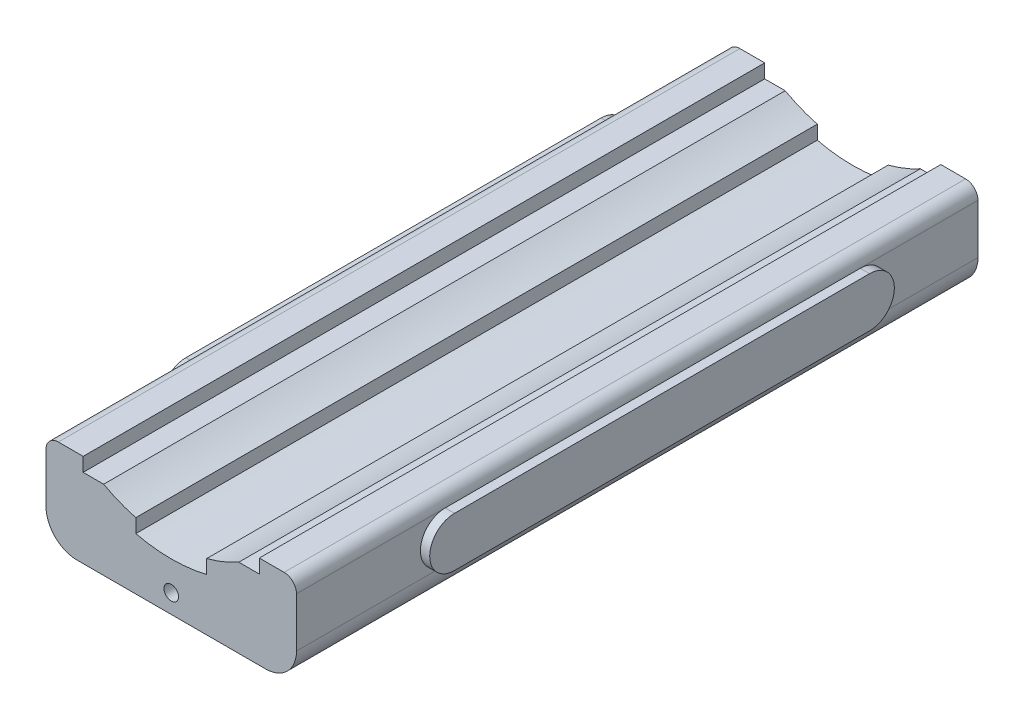
ISO-10303-21;
HEADER;
FILE_DESCRIPTION(('STEP AP214'),'2;1');
FILE_NAME('part.step','',(''),(''),'','','');
FILE_SCHEMA(('AUTOMOTIVE_DESIGN { 1 0 10303 214 1 1 1 1 }'));
ENDSEC;
DATA;
#1=APPLICATION_CONTEXT('core data for automotive mechanical design processes');
#2=APPLICATION_PROTOCOL_DEFINITION('international standard','automotive_design',2000,#1);
#3=PRODUCT_CONTEXT('',#1,'mechanical');
#4=PRODUCT('Part','Part','',(#3));
#5=PRODUCT_RELATED_PRODUCT_CATEGORY('part','',(#4));
#6=PRODUCT_DEFINITION_FORMATION('','',#4);
#7=PRODUCT_DEFINITION_CONTEXT('part definition',#1,'design');
#8=PRODUCT_DEFINITION('design','',#6,#7);
#9=PRODUCT_DEFINITION_SHAPE('','',#8);
#10=(LENGTH_UNIT() NAMED_UNIT(*) SI_UNIT(.MILLI.,.METRE.));
#11=(NAMED_UNIT(*) PLANE_ANGLE_UNIT() SI_UNIT($,.RADIAN.));
#12=(NAMED_UNIT(*) SI_UNIT($,.STERADIAN.) SOLID_ANGLE_UNIT());
#13=UNCERTAINTY_MEASURE_WITH_UNIT(LENGTH_MEASURE(1.E-05),#10,'distance_accuracy_value','');
#14=(GEOMETRIC_REPRESENTATION_CONTEXT(3) GLOBAL_UNCERTAINTY_ASSIGNED_CONTEXT((#13)) GLOBAL_UNIT_ASSIGNED_CONTEXT((#10,
#11,#12)) REPRESENTATION_CONTEXT('',''));
#15=CARTESIAN_POINT('',(0.,0.,0.));
#16=DIRECTION('',(0.,0.,1.));
#17=DIRECTION('',(1.,0.,0.));
#18=AXIS2_PLACEMENT_3D('',#15,#16,#17);
#19=CARTESIAN_POINT('',(367.19802957243,117.225625203814,-746.69724518585));
#20=DIRECTION('',(1.,0.,0.));
#21=DIRECTION('',(0.,0.,-1.));
#22=AXIS2_PLACEMENT_3D('',#19,#20,#21);
#23=PLANE('',#22);
#24=DIRECTION('',(0.,0.,-1.));
#25=VECTOR('',#24,1.);
#26=CARTESIAN_POINT('',(367.19802957243,-38.7743747961858,657.302754814149));
#27=LINE('',#26,#25);
#28=CARTESIAN_POINT('',(367.19802957243,-38.7743747961858,594.902754814149));
#29=VERTEX_POINT('',#28);
#30=CARTESIAN_POINT('',(367.19802957243,-38.7743747961858,-450.29724518585));
#31=VERTEX_POINT('',#30);
#32=EDGE_CURVE('E291',#29,#31,#27,.T.);
#33=ORIENTED_EDGE('',*,*,#32,.T.);
#34=CARTESIAN_POINT('',(367.19802957243,23.6256252038142,-450.29724518585));
#35=DIRECTION('',(1.,0.,0.));
#36=DIRECTION('',(0.,0.,-1.));
#37=AXIS2_PLACEMENT_3D('',#34,#35,#36);
#38=CIRCLE('',#37,62.4);
#39=CARTESIAN_POINT('',(367.19802957243,86.0256252038141,-450.29724518585));
#40=VERTEX_POINT('',#39);
#41=EDGE_CURVE('E273',#40,#31,#38,.F.);
#42=ORIENTED_EDGE('',*,*,#41,.F.);
#43=DIRECTION('',(0.,0.,1.));
#44=VECTOR('',#43,1.);
#45=CARTESIAN_POINT('',(367.19802957243,86.0256252038141,657.302754814149));
#46=LINE('',#45,#44);
#47=CARTESIAN_POINT('',(367.19802957243,86.0256252038141,594.902754814149));
#48=VERTEX_POINT('',#47);
#49=EDGE_CURVE('E297',#40,#48,#46,.T.);
#50=ORIENTED_EDGE('',*,*,#49,.T.);
#51=CARTESIAN_POINT('',(367.19802957243,23.6256252038142,594.902754814149));
#52=DIRECTION('',(1.,0.,0.));
#53=DIRECTION('',(0.,0.,-1.));
#54=AXIS2_PLACEMENT_3D('',#51,#52,#53);
#55=CIRCLE('',#54,62.4);
#56=EDGE_CURVE('E446',#48,#29,#55,.T.);
#57=ORIENTED_EDGE('',*,*,#56,.T.);
#58=EDGE_LOOP('',(#33,#42,#50,#57));
#59=FACE_BOUND('',#58,.T.);
#60=ADVANCED_FACE('F76',(#59),#23,.T.);
#61=CARTESIAN_POINT('',(367.19802957243,-38.7743747961858,657.302754814149));
#62=DIRECTION('',(0.,1.,0.));
#63=DIRECTION('',(0.,0.,1.));
#64=AXIS2_PLACEMENT_3D('',#61,#62,#63);
#65=PLANE('',#64);
#66=DIRECTION('',(1.,0.,0.));
#67=VECTOR('',#66,1.);
#68=CARTESIAN_POINT('',(343.79802957243,-38.7743747961858,-450.29724518585));
#69=LINE('',#68,#67);
#70=CARTESIAN_POINT('',(343.79802957243,-38.7743747961858,-450.29724518585));
#71=VERTEX_POINT('',#70);
#72=EDGE_CURVE('E276',#71,#31,#69,.T.);
#73=ORIENTED_EDGE('',*,*,#72,.T.);
#74=ORIENTED_EDGE('',*,*,#32,.F.);
#75=DIRECTION('',(1.,0.,0.));
#76=VECTOR('',#75,1.);
#77=CARTESIAN_POINT('',(343.79802957243,-38.7743747961858,594.902754814149));
#78=LINE('',#77,#76);
#79=CARTESIAN_POINT('',(343.79802957243,-38.7743747961858,594.902754814149));
#80=VERTEX_POINT('',#79);
#81=EDGE_CURVE('E287',#80,#29,#78,.T.);
#82=ORIENTED_EDGE('',*,*,#81,.F.);
#83=DIRECTION('',(0.,0.,-1.));
#84=VECTOR('',#83,1.);
#85=CARTESIAN_POINT('',(343.79802957243,-38.7743747961858,657.302754814149));
#86=LINE('',#85,#84);
#87=EDGE_CURVE('E256',#80,#71,#86,.T.);
#88=ORIENTED_EDGE('',*,*,#87,.T.);
#89=EDGE_LOOP('',(#73,#74,#82,#88));
#90=FACE_BOUND('',#89,.T.);
#91=ADVANCED_FACE('F285',(#90),#65,.F.);
#92=CARTESIAN_POINT('',(-310.334841033241,117.225625203814,-746.69724518585));
#93=DIRECTION('',(1.,0.,0.));
#94=DIRECTION('',(0.,1.,0.));
#95=AXIS2_PLACEMENT_3D('',#92,#93,#94);
#96=PLANE('',#95);
#97=CARTESIAN_POINT('',(-310.334841033241,23.6256252038142,593.531968518522));
#98=DIRECTION('',(-1.,0.,0.));
#99=DIRECTION('',(0.,-1.,0.));
#100=AXIS2_PLACEMENT_3D('',#97,#98,#99);
#101=CIRCLE('',#100,62.4);
#102=CARTESIAN_POINT('',(-310.334841033241,86.0256252038141,593.531968518521));
#103=VERTEX_POINT('',#102);
#104=CARTESIAN_POINT('',(-310.334841033241,-38.7743747961858,593.531968518522));
#105=VERTEX_POINT('',#104);
#106=EDGE_CURVE('E452',#103,#105,#101,.F.);
#107=ORIENTED_EDGE('',*,*,#106,.F.);
#108=DIRECTION('',(0.,0.,-1.));
#109=VECTOR('',#108,1.);
#110=CARTESIAN_POINT('',(-310.334841033241,86.0256252038141,655.931968518522));
#111=LINE('',#110,#109);
#112=CARTESIAN_POINT('',(-310.334841033241,86.0256252038141,-451.668031481478));
#113=VERTEX_POINT('',#112);
#114=EDGE_CURVE('E294',#103,#113,#111,.T.);
#115=ORIENTED_EDGE('',*,*,#114,.T.);
#116=CARTESIAN_POINT('',(-310.334841033241,23.6256252038142,-451.668031481478));
#117=DIRECTION('',(-1.,0.,0.));
#118=DIRECTION('',(0.,-1.,0.));
#119=AXIS2_PLACEMENT_3D('',#116,#117,#118);
#120=CIRCLE('',#119,62.4);
#121=CARTESIAN_POINT('',(-310.334841033241,-38.7743747961858,-451.668031481478));
#122=VERTEX_POINT('',#121);
#123=EDGE_CURVE('E466',#113,#122,#120,.T.);
#124=ORIENTED_EDGE('',*,*,#123,.T.);
#125=DIRECTION('',(0.,0.,1.));
#126=VECTOR('',#125,1.);
#127=CARTESIAN_POINT('',(-310.334841033241,-38.7743747961858,655.931968518522));
#128=LINE('',#127,#126);
#129=EDGE_CURVE('E289',#122,#105,#128,.T.);
#130=ORIENTED_EDGE('',*,*,#129,.T.);
#131=EDGE_LOOP('',(#107,#115,#124,#130));
#132=FACE_BOUND('',#131,.T.);
#133=ADVANCED_FACE('F516',(#132),#96,.F.);
#134=CARTESIAN_POINT('',(-310.334841033241,-38.7743747961858,655.931968518522));
#135=DIRECTION('',(0.,1.,0.));
#136=DIRECTION('',(-1.,0.,0.));
#137=AXIS2_PLACEMENT_3D('',#134,#135,#136);
#138=PLANE('',#137);
#139=DIRECTION('',(-1.,0.,0.));
#140=VECTOR('',#139,1.);
#141=CARTESIAN_POINT('',(-286.934841033241,-38.7743747961858,593.531968518522));
#142=LINE('',#141,#140);
#143=CARTESIAN_POINT('',(-286.934841033241,-38.7743747961858,593.531968518522));
#144=VERTEX_POINT('',#143);
#145=EDGE_CURVE('E459',#144,#105,#142,.T.);
#146=ORIENTED_EDGE('',*,*,#145,.T.);
#147=ORIENTED_EDGE('',*,*,#129,.F.);
#148=DIRECTION('',(-1.,0.,0.));
#149=VECTOR('',#148,1.);
#150=CARTESIAN_POINT('',(-286.934841033241,-38.7743747961858,-451.668031481478));
#151=LINE('',#150,#149);
#152=CARTESIAN_POINT('',(-286.934841033241,-38.7743747961858,-451.668031481478));
#153=VERTEX_POINT('',#152);
#154=EDGE_CURVE('E91',#153,#122,#151,.T.);
#155=ORIENTED_EDGE('',*,*,#154,.F.);
#156=DIRECTION('',(0.,0.,1.));
#157=VECTOR('',#156,1.);
#158=CARTESIAN_POINT('',(-286.934841033241,-38.7743747961858,655.931968518522));
#159=LINE('',#158,#157);
#160=EDGE_CURVE('E472',#153,#144,#159,.T.);
#161=ORIENTED_EDGE('',*,*,#160,.T.);
#162=EDGE_LOOP('',(#146,#147,#155,#161));
#163=FACE_BOUND('',#162,.T.);
#164=ADVANCED_FACE('F605',(#163),#138,.F.);
#165=CARTESIAN_POINT('',(-286.934841033241,117.225625203814,969.302754814149));
#166=DIRECTION('',(1.,0.,0.));
#167=DIRECTION('',(0.,1.,0.));
#168=AXIS2_PLACEMENT_3D('',#165,#166,#167);
#169=PLANE('',#168);
#170=DIRECTION('',(0.,0.,-1.));
#171=VECTOR('',#170,1.);
#172=CARTESIAN_POINT('',(-286.934841033241,86.0256252038141,969.302754814149));
#173=LINE('',#172,#171);
#174=CARTESIAN_POINT('',(-286.934841033241,86.0256252038141,969.302754814149));
#175=VERTEX_POINT('',#174);
#176=CARTESIAN_POINT('',(-286.934841033241,86.0256252038141,593.531968518521));
#177=VERTEX_POINT('',#176);
#178=EDGE_CURVE('E398',#175,#177,#173,.T.);
#179=ORIENTED_EDGE('',*,*,#178,.T.);
#180=CARTESIAN_POINT('',(-286.934841033241,23.6256252038142,593.531968518522));
#181=DIRECTION('',(-1.,0.,0.));
#182=DIRECTION('',(0.,-1.,0.));
#183=AXIS2_PLACEMENT_3D('',#180,#181,#182);
#184=CIRCLE('',#183,62.4);
#185=EDGE_CURVE('E457',#177,#144,#184,.F.);
#186=ORIENTED_EDGE('',*,*,#185,.T.);
#187=DIRECTION('',(0.,0.,-1.));
#188=VECTOR('',#187,1.);
#189=CARTESIAN_POINT('',(-286.934841033241,-38.7743747961858,969.302754814149));
#190=LINE('',#189,#188);
#191=CARTESIAN_POINT('',(-286.934841033241,-38.7743747961858,969.302754814149));
#192=VERTEX_POINT('',#191);
#193=EDGE_CURVE('E84',#144,#192,#190,.F.);
#194=ORIENTED_EDGE('',*,*,#193,.T.);
#195=DIRECTION('',(0.,-1.,0.));
#196=VECTOR('',#195,1.);
#197=CARTESIAN_POINT('',(-286.934841033241,117.225625203814,969.302754814149));
#198=LINE('',#197,#196);
#199=EDGE_CURVE('E322',#175,#192,#198,.T.);
#200=ORIENTED_EDGE('',*,*,#199,.F.);
#201=EDGE_LOOP('',(#179,#186,#194,#200));
#202=FACE_BOUND('',#201,.T.);
#203=ADVANCED_FACE('F594',(#202),#169,.F.);
#204=CARTESIAN_POINT('',(-286.934841033241,23.6256252038142,-451.668031481478));
#205=DIRECTION('',(-1.,0.,0.));
#206=DIRECTION('',(0.,-1.,0.));
#207=AXIS2_PLACEMENT_3D('',#204,#205,#206);
#208=CIRCLE('',#207,62.4);
#209=CARTESIAN_POINT('',(-286.934841033241,86.0256252038141,-451.668031481478));
#210=VERTEX_POINT('',#209);
#211=EDGE_CURVE('E467',#210,#153,#208,.T.);
#212=ORIENTED_EDGE('',*,*,#211,.F.);
#213=CARTESIAN_POINT('',(-286.934841033241,86.0256252038141,-746.69724518585));
#214=VERTEX_POINT('',#213);
#215=EDGE_CURVE('E397',#210,#214,#173,.T.);
#216=ORIENTED_EDGE('',*,*,#215,.T.);
#217=DIRECTION('',(0.,-1.,0.));
#218=VECTOR('',#217,1.);
#219=CARTESIAN_POINT('',(-286.934841033241,117.225625203814,-746.69724518585));
#220=LINE('',#219,#218);
#221=CARTESIAN_POINT('',(-286.934841033241,-38.7743747961858,-746.69724518585));
#222=VERTEX_POINT('',#221);
#223=EDGE_CURVE('E360',#214,#222,#220,.T.);
#224=ORIENTED_EDGE('',*,*,#223,.T.);
#225=EDGE_CURVE('E12',#222,#153,#190,.F.);
#226=ORIENTED_EDGE('',*,*,#225,.T.);
#227=EDGE_LOOP('',(#212,#216,#224,#226));
#228=FACE_BOUND('',#227,.T.);
#229=ADVANCED_FACE('F607',(#228),#169,.F.);
#230=CARTESIAN_POINT('',(343.79802957243,117.225625203814,969.302754814149));
#231=DIRECTION('',(1.,0.,0.));
#232=DIRECTION('',(0.,0.,-1.));
#233=AXIS2_PLACEMENT_3D('',#230,#231,#232);
#234=PLANE('',#233);
#235=DIRECTION('',(0.,0.,-1.));
#236=VECTOR('',#235,1.);
#237=CARTESIAN_POINT('',(343.79802957243,-38.7743747961858,-746.69724518585));
#238=LINE('',#237,#236);
#239=CARTESIAN_POINT('',(343.79802957243,-38.7743747961858,969.302754814149));
#240=VERTEX_POINT('',#239);
#241=EDGE_CURVE('E262',#240,#80,#238,.T.);
#242=ORIENTED_EDGE('',*,*,#241,.T.);
#243=CARTESIAN_POINT('',(343.79802957243,23.6256252038142,594.902754814149));
#244=DIRECTION('',(1.,0.,0.));
#245=DIRECTION('',(0.,0.,-1.));
#246=AXIS2_PLACEMENT_3D('',#243,#244,#245);
#247=CIRCLE('',#246,62.4);
#248=CARTESIAN_POINT('',(343.79802957243,86.0256252038141,594.902754814149));
#249=VERTEX_POINT('',#248);
#250=EDGE_CURVE('E435',#249,#80,#247,.T.);
#251=ORIENTED_EDGE('',*,*,#250,.F.);
#252=DIRECTION('',(0.,0.,-1.));
#253=VECTOR('',#252,1.);
#254=CARTESIAN_POINT('',(343.79802957243,86.0256252038141,969.302754814149));
#255=LINE('',#254,#253);
#256=CARTESIAN_POINT('',(343.79802957243,86.0256252038141,969.302754814149));
#257=VERTEX_POINT('',#256);
#258=EDGE_CURVE('E413',#249,#257,#255,.F.);
#259=ORIENTED_EDGE('',*,*,#258,.T.);
#260=DIRECTION('',(0.,-1.,0.));
#261=VECTOR('',#260,1.);
#262=CARTESIAN_POINT('',(343.79802957243,117.225625203814,969.302754814149));
#263=LINE('',#262,#261);
#264=EDGE_CURVE('E327',#257,#240,#263,.T.);
#265=ORIENTED_EDGE('',*,*,#264,.T.);
#266=EDGE_LOOP('',(#242,#251,#259,#265));
#267=FACE_BOUND('',#266,.T.);
#268=ADVANCED_FACE('F431',(#267),#234,.T.);
#269=CARTESIAN_POINT('',(343.79802957243,86.0256252038141,-746.69724518585));
#270=VERTEX_POINT('',#269);
#271=CARTESIAN_POINT('',(343.79802957243,86.0256252038141,-450.29724518585));
#272=VERTEX_POINT('',#271);
#273=EDGE_CURVE('E263',#270,#272,#255,.F.);
#274=ORIENTED_EDGE('',*,*,#273,.T.);
#275=CARTESIAN_POINT('',(343.79802957243,23.6256252038142,-450.29724518585));
#276=DIRECTION('',(1.,0.,0.));
#277=DIRECTION('',(0.,0.,-1.));
#278=AXIS2_PLACEMENT_3D('',#275,#276,#277);
#279=CIRCLE('',#278,62.4);
#280=EDGE_CURVE('E266',#272,#71,#279,.F.);
#281=ORIENTED_EDGE('',*,*,#280,.T.);
#282=CARTESIAN_POINT('',(343.79802957243,-38.7743747961858,-746.69724518585));
#283=VERTEX_POINT('',#282);
#284=EDGE_CURVE('E250',#71,#283,#238,.T.);
#285=ORIENTED_EDGE('',*,*,#284,.T.);
#286=DIRECTION('',(0.,-1.,0.));
#287=VECTOR('',#286,1.);
#288=CARTESIAN_POINT('',(343.79802957243,117.225625203814,-746.69724518585));
#289=LINE('',#288,#287);
#290=EDGE_CURVE('E366',#270,#283,#289,.T.);
#291=ORIENTED_EDGE('',*,*,#290,.F.);
#292=EDGE_LOOP('',(#274,#281,#285,#291));
#293=FACE_BOUND('',#292,.T.);
#294=ADVANCED_FACE('F268',(#293),#234,.T.);
#295=CARTESIAN_POINT('',(28.4315942695943,389.292984828362,969.302754814149));
#296=DIRECTION('',(0.,0.,-1.));
#297=DIRECTION('',(-1.,0.,0.));
#298=AXIS2_PLACEMENT_3D('',#295,#296,#297);
#299=CYLINDRICAL_SURFACE('',#298,351.);
#300=CARTESIAN_POINT('',(28.4315942695943,389.292984828362,-746.69724518585));
#301=DIRECTION('',(0.,0.,1.));
#302=DIRECTION('',(1.,0.,0.));
#303=AXIS2_PLACEMENT_3D('',#300,#301,#302);
#304=CIRCLE('',#303,351.);
#305=CARTESIAN_POINT('',(117.707946393413,49.8364589646461,-746.69724518585));
#306=VERTEX_POINT('',#305);
#307=CARTESIAN_POINT('',(198.555103217828,82.2767121274838,-746.69724518585));
#308=VERTEX_POINT('',#307);
#309=EDGE_CURVE('E338',#306,#308,#304,.T.);
#310=ORIENTED_EDGE('',*,*,#309,.F.);
#311=DIRECTION('',(0.,0.,-1.));
#312=VECTOR('',#311,1.);
#313=CARTESIAN_POINT('',(117.707946393413,49.8364589646461,969.302754814149));
#314=LINE('',#313,#312);
#315=CARTESIAN_POINT('',(117.707946393413,49.8364589646461,969.302754814149));
#316=VERTEX_POINT('',#315);
#317=EDGE_CURVE('E395',#316,#306,#314,.T.);
#318=ORIENTED_EDGE('',*,*,#317,.F.);
#319=CARTESIAN_POINT('',(28.4315942695943,389.292984828362,969.302754814149));
#320=DIRECTION('',(0.,0.,1.));
#321=DIRECTION('',(1.,0.,0.));
#322=AXIS2_PLACEMENT_3D('',#319,#320,#321);
#323=CIRCLE('',#322,351.);
#324=CARTESIAN_POINT('',(198.555103217828,82.2767121274838,969.302754814149));
#325=VERTEX_POINT('',#324);
#326=EDGE_CURVE('E300',#316,#325,#323,.T.);
#327=ORIENTED_EDGE('',*,*,#326,.T.);
#328=DIRECTION('',(0.,0.,-1.));
#329=VECTOR('',#328,1.);
#330=CARTESIAN_POINT('',(198.555103217828,82.2767121274838,969.302754814149));
#331=LINE('',#330,#329);
#332=EDGE_CURVE('E337',#325,#308,#331,.T.);
#333=ORIENTED_EDGE('',*,*,#332,.T.);
#334=EDGE_LOOP('',(#310,#318,#327,#333));
#335=FACE_BOUND('',#334,.T.);
#336=ADVANCED_FACE('F557',(#335),#299,.F.);
#337=CARTESIAN_POINT('',(117.707946393413,117.225625203813,969.302754814149));
#338=DIRECTION('',(1.,0.,0.));
#339=DIRECTION('',(0.,1.,0.));
#340=AXIS2_PLACEMENT_3D('',#337,#338,#339);
#341=PLANE('',#340);
#342=DIRECTION('',(0.,-1.,0.));
#343=VECTOR('',#342,1.);
#344=CARTESIAN_POINT('',(117.707946393413,117.225625203813,-746.69724518585));
#345=LINE('',#344,#343);
#346=CARTESIAN_POINT('',(117.707946393412,14.8875458883158,-746.69724518585));
#347=VERTEX_POINT('',#346);
#348=EDGE_CURVE('E341',#306,#347,#345,.T.);
#349=ORIENTED_EDGE('',*,*,#348,.T.);
#350=DIRECTION('',(0.,0.,-1.));
#351=VECTOR('',#350,1.);
#352=CARTESIAN_POINT('',(117.707946393412,14.8875458883158,969.302754814149));
#353=LINE('',#352,#351);
#354=CARTESIAN_POINT('',(117.707946393412,14.8875458883158,969.302754814149));
#355=VERTEX_POINT('',#354);
#356=EDGE_CURVE('E393',#355,#347,#353,.T.);
#357=ORIENTED_EDGE('',*,*,#356,.F.);
#358=DIRECTION('',(0.,-1.,0.));
#359=VECTOR('',#358,1.);
#360=CARTESIAN_POINT('',(117.707946393413,117.225625203813,969.302754814149));
#361=LINE('',#360,#359);
#362=EDGE_CURVE('E303',#316,#355,#361,.T.);
#363=ORIENTED_EDGE('',*,*,#362,.F.);
#364=ORIENTED_EDGE('',*,*,#317,.T.);
#365=EDGE_LOOP('',(#349,#357,#363,#364));
#366=FACE_BOUND('',#365,.T.);
#367=ADVANCED_FACE('F560',(#366),#341,.F.);
#368=CARTESIAN_POINT('',(28.4315942695943,389.292984828362,969.302754814149));
#369=DIRECTION('',(0.,0.,-1.));
#370=DIRECTION('',(-1.,0.,0.));
#371=AXIS2_PLACEMENT_3D('',#368,#369,#370);
#372=CYLINDRICAL_SURFACE('',#371,384.90219505275);
#373=CARTESIAN_POINT('',(28.4315942695943,389.292984828362,-746.69724518585));
#374=DIRECTION('',(0.,0.,1.));
#375=DIRECTION('',(1.,0.,0.));
#376=AXIS2_PLACEMENT_3D('',#373,#374,#375);
#377=CIRCLE('',#376,384.90219505275);
#378=CARTESIAN_POINT('',(-60.8447578542241,14.8875458883158,-746.69724518585));
#379=VERTEX_POINT('',#378);
#380=EDGE_CURVE('E344',#379,#347,#377,.T.);
#381=ORIENTED_EDGE('',*,*,#380,.F.);
#382=DIRECTION('',(0.,0.,-1.));
#383=VECTOR('',#382,1.);
#384=CARTESIAN_POINT('',(-60.8447578542241,14.8875458883158,969.302754814149));
#385=LINE('',#384,#383);
#386=CARTESIAN_POINT('',(-60.8447578542241,14.8875458883158,969.302754814149));
#387=VERTEX_POINT('',#386);
#388=EDGE_CURVE('E391',#387,#379,#385,.T.);
#389=ORIENTED_EDGE('',*,*,#388,.F.);
#390=CARTESIAN_POINT('',(28.4315942695943,389.292984828362,969.302754814149));
#391=DIRECTION('',(0.,0.,1.));
#392=DIRECTION('',(1.,0.,0.));
#393=AXIS2_PLACEMENT_3D('',#390,#391,#392);
#394=CIRCLE('',#393,384.90219505275);
#395=EDGE_CURVE('E306',#387,#355,#394,.T.);
#396=ORIENTED_EDGE('',*,*,#395,.T.);
#397=ORIENTED_EDGE('',*,*,#356,.T.);
#398=EDGE_LOOP('',(#381,#389,#396,#397));
#399=FACE_BOUND('',#398,.T.);
#400=ADVANCED_FACE('F563',(#399),#372,.F.);
#401=CARTESIAN_POINT('',(-60.8447578542247,117.225625203815,969.302754814149));
#402=DIRECTION('',(1.,0.,0.));
#403=DIRECTION('',(0.,1.,0.));
#404=AXIS2_PLACEMENT_3D('',#401,#402,#403);
#405=PLANE('',#404);
#406=DIRECTION('',(0.,-1.,0.));
#407=VECTOR('',#406,1.);
#408=CARTESIAN_POINT('',(-60.8447578542247,117.225625203815,-746.69724518585));
#409=LINE('',#408,#407);
#410=CARTESIAN_POINT('',(-60.8447578542243,49.8364589646461,-746.69724518585));
#411=VERTEX_POINT('',#410);
#412=EDGE_CURVE('E347',#411,#379,#409,.T.);
#413=ORIENTED_EDGE('',*,*,#412,.F.);
#414=DIRECTION('',(0.,0.,-1.));
#415=VECTOR('',#414,1.);
#416=CARTESIAN_POINT('',(-60.8447578542243,49.8364589646461,969.302754814149));
#417=LINE('',#416,#415);
#418=CARTESIAN_POINT('',(-60.8447578542243,49.8364589646461,969.302754814149));
#419=VERTEX_POINT('',#418);
#420=EDGE_CURVE('E389',#419,#411,#417,.T.);
#421=ORIENTED_EDGE('',*,*,#420,.F.);
#422=DIRECTION('',(0.,-1.,0.));
#423=VECTOR('',#422,1.);
#424=CARTESIAN_POINT('',(-60.8447578542247,117.225625203815,969.302754814149));
#425=LINE('',#424,#423);
#426=EDGE_CURVE('E309',#419,#387,#425,.T.);
#427=ORIENTED_EDGE('',*,*,#426,.T.);
#428=ORIENTED_EDGE('',*,*,#388,.T.);
#429=EDGE_LOOP('',(#413,#421,#427,#428));
#430=FACE_BOUND('',#429,.T.);
#431=ADVANCED_FACE('F568',(#430),#405,.T.);
#432=CARTESIAN_POINT('',(28.4315942695943,389.292984828362,969.302754814149));
#433=DIRECTION('',(0.,0.,-1.));
#434=DIRECTION('',(-1.,0.,0.));
#435=AXIS2_PLACEMENT_3D('',#432,#433,#434);
#436=CYLINDRICAL_SURFACE('',#435,351.);
#437=CARTESIAN_POINT('',(28.4315942695943,389.292984828362,-746.69724518585));
#438=DIRECTION('',(0.,0.,1.));
#439=DIRECTION('',(1.,0.,0.));
#440=AXIS2_PLACEMENT_3D('',#437,#438,#439);
#441=CIRCLE('',#440,351.);
#442=CARTESIAN_POINT('',(-141.69191467864,82.2767121274839,-746.69724518585));
#443=VERTEX_POINT('',#442);
#444=EDGE_CURVE('E350',#443,#411,#441,.T.);
#445=ORIENTED_EDGE('',*,*,#444,.F.);
#446=DIRECTION('',(0.,0.,-1.));
#447=VECTOR('',#446,1.);
#448=CARTESIAN_POINT('',(-141.69191467864,82.2767121274839,969.302754814149));
#449=LINE('',#448,#447);
#450=CARTESIAN_POINT('',(-141.69191467864,82.2767121274839,969.302754814149));
#451=VERTEX_POINT('',#450);
#452=EDGE_CURVE('E387',#451,#443,#449,.T.);
#453=ORIENTED_EDGE('',*,*,#452,.F.);
#454=CARTESIAN_POINT('',(28.4315942695943,389.292984828362,969.302754814149));
#455=DIRECTION('',(0.,0.,1.));
#456=DIRECTION('',(1.,0.,0.));
#457=AXIS2_PLACEMENT_3D('',#454,#455,#456);
#458=CIRCLE('',#457,351.);
#459=EDGE_CURVE('E312',#451,#419,#458,.T.);
#460=ORIENTED_EDGE('',*,*,#459,.T.);
#461=ORIENTED_EDGE('',*,*,#420,.T.);
#462=EDGE_LOOP('',(#445,#453,#460,#461));
#463=FACE_BOUND('',#462,.T.);
#464=ADVANCED_FACE('F571',(#463),#436,.F.);
#465=CARTESIAN_POINT('',(-193.334841033241,82.2767121274839,969.302754814149));
#466=DIRECTION('',(0.,-1.,0.));
#467=DIRECTION('',(0.,0.,-1.));
#468=AXIS2_PLACEMENT_3D('',#465,#466,#467);
#469=PLANE('',#468);
#470=DIRECTION('',(-1.,0.,0.));
#471=VECTOR('',#470,1.);
#472=CARTESIAN_POINT('',(-193.334841033241,82.2767121274839,-746.69724518585));
#473=LINE('',#472,#471);
#474=CARTESIAN_POINT('',(-193.334841033241,82.2767121274839,-746.69724518585));
#475=VERTEX_POINT('',#474);
#476=EDGE_CURVE('E353',#443,#475,#473,.T.);
#477=ORIENTED_EDGE('',*,*,#476,.T.);
#478=DIRECTION('',(0.,0.,-1.));
#479=VECTOR('',#478,1.);
#480=CARTESIAN_POINT('',(-193.334841033241,82.2767121274839,969.302754814149));
#481=LINE('',#480,#479);
#482=CARTESIAN_POINT('',(-193.334841033241,82.2767121274839,969.302754814149));
#483=VERTEX_POINT('',#482);
#484=EDGE_CURVE('E384',#483,#475,#481,.T.);
#485=ORIENTED_EDGE('',*,*,#484,.F.);
#486=DIRECTION('',(-1.,0.,0.));
#487=VECTOR('',#486,1.);
#488=CARTESIAN_POINT('',(-193.334841033241,82.2767121274839,969.302754814149));
#489=LINE('',#488,#487);
#490=EDGE_CURVE('E315',#451,#483,#489,.T.);
#491=ORIENTED_EDGE('',*,*,#490,.F.);
#492=ORIENTED_EDGE('',*,*,#452,.T.);
#493=EDGE_LOOP('',(#477,#485,#491,#492));
#494=FACE_BOUND('',#493,.T.);
#495=ADVANCED_FACE('F577',(#494),#469,.F.);
#496=CARTESIAN_POINT('',(-193.334841033241,117.225625203814,969.302754814149));
#497=DIRECTION('',(-1.,0.,0.));
#498=DIRECTION('',(0.,0.,1.));
#499=AXIS2_PLACEMENT_3D('',#496,#497,#498);
#500=PLANE('',#499);
#501=DIRECTION('',(0.,1.,0.));
#502=VECTOR('',#501,1.);
#503=CARTESIAN_POINT('',(-193.334841033241,117.225625203814,-746.69724518585));
#504=LINE('',#503,#502);
#505=CARTESIAN_POINT('',(-193.334841033241,117.225625203814,-746.69724518585));
#506=VERTEX_POINT('',#505);
#507=EDGE_CURVE('E355',#475,#506,#504,.T.);
#508=ORIENTED_EDGE('',*,*,#507,.T.);
#509=DIRECTION('',(0.,0.,-1.));
#510=VECTOR('',#509,1.);
#511=CARTESIAN_POINT('',(-193.334841033241,117.225625203814,969.302754814149));
#512=LINE('',#511,#510);
#513=CARTESIAN_POINT('',(-193.334841033241,117.225625203814,969.302754814149));
#514=VERTEX_POINT('',#513);
#515=EDGE_CURVE('E381',#514,#506,#512,.T.);
#516=ORIENTED_EDGE('',*,*,#515,.F.);
#517=DIRECTION('',(0.,1.,0.));
#518=VECTOR('',#517,1.);
#519=CARTESIAN_POINT('',(-193.334841033241,117.225625203814,969.302754814149));
#520=LINE('',#519,#518);
#521=EDGE_CURVE('E317',#483,#514,#520,.T.);
#522=ORIENTED_EDGE('',*,*,#521,.F.);
#523=ORIENTED_EDGE('',*,*,#484,.T.);
#524=EDGE_LOOP('',(#508,#516,#522,#523));
#525=FACE_BOUND('',#524,.T.);
#526=ADVANCED_FACE('F581',(#525),#500,.F.);
#527=CARTESIAN_POINT('',(-193.334841033241,117.225625203814,969.302754814149));
#528=DIRECTION('',(0.,-1.,0.));
#529=DIRECTION('',(1.,0.,0.));
#530=AXIS2_PLACEMENT_3D('',#527,#528,#529);
#531=PLANE('',#530);
#532=DIRECTION('',(-1.,0.,0.));
#533=VECTOR('',#532,1.);
#534=CARTESIAN_POINT('',(-193.334841033241,117.225625203814,-746.69724518585));
#535=LINE('',#534,#533);
#536=CARTESIAN_POINT('',(-255.734841033241,117.225625203814,-746.69724518585));
#537=VERTEX_POINT('',#536);
#538=EDGE_CURVE('E357',#506,#537,#535,.T.);
#539=ORIENTED_EDGE('',*,*,#538,.T.);
#540=DIRECTION('',(0.,0.,-1.));
#541=VECTOR('',#540,1.);
#542=CARTESIAN_POINT('',(-255.734841033241,117.225625203814,969.302754814149));
#543=LINE('',#542,#541);
#544=CARTESIAN_POINT('',(-255.734841033241,117.225625203814,969.302754814149));
#545=VERTEX_POINT('',#544);
#546=EDGE_CURVE('E404',#537,#545,#543,.F.);
#547=ORIENTED_EDGE('',*,*,#546,.T.);
#548=DIRECTION('',(-1.,0.,0.));
#549=VECTOR('',#548,1.);
#550=CARTESIAN_POINT('',(-193.334841033241,117.225625203814,969.302754814149));
#551=LINE('',#550,#549);
#552=EDGE_CURVE('E319',#514,#545,#551,.T.);
#553=ORIENTED_EDGE('',*,*,#552,.F.);
#554=ORIENTED_EDGE('',*,*,#515,.T.);
#555=EDGE_LOOP('',(#539,#547,#553,#554));
#556=FACE_BOUND('',#555,.T.);
#557=ADVANCED_FACE('F585',(#556),#531,.F.);
#558=CARTESIAN_POINT('',(-193.334841033241,-116.774374796186,969.302754814149));
#559=DIRECTION('',(0.,1.,0.));
#560=DIRECTION('',(0.,0.,1.));
#561=AXIS2_PLACEMENT_3D('',#558,#559,#560);
#562=PLANE('',#561);
#563=DIRECTION('',(1.,0.,0.));
#564=VECTOR('',#563,1.);
#565=CARTESIAN_POINT('',(-193.334841033241,-116.774374796186,-746.69724518585));
#566=LINE('',#565,#564);
#567=CARTESIAN_POINT('',(-208.934841033241,-116.774374796186,-746.69724518585));
#568=VERTEX_POINT('',#567);
#569=CARTESIAN_POINT('',(265.79802957243,-116.774374796186,-746.69724518585));
#570=VERTEX_POINT('',#569);
#571=EDGE_CURVE('E363',#568,#570,#566,.T.);
#572=ORIENTED_EDGE('',*,*,#571,.T.);
#573=DIRECTION('',(0.,0.,-1.));
#574=VECTOR('',#573,1.);
#575=CARTESIAN_POINT('',(265.79802957243,-116.774374796186,969.302754814149));
#576=LINE('',#575,#574);
#577=CARTESIAN_POINT('',(265.79802957243,-116.774374796186,969.302754814149));
#578=VERTEX_POINT('',#577);
#579=EDGE_CURVE('E421',#570,#578,#576,.F.);
#580=ORIENTED_EDGE('',*,*,#579,.T.);
#581=DIRECTION('',(1.,0.,0.));
#582=VECTOR('',#581,1.);
#583=CARTESIAN_POINT('',(-193.334841033241,-116.774374796186,969.302754814149));
#584=LINE('',#583,#582);
#585=CARTESIAN_POINT('',(-208.934841033241,-116.774374796186,969.302754814149));
#586=VERTEX_POINT('',#585);
#587=EDGE_CURVE('E324',#586,#578,#584,.T.);
#588=ORIENTED_EDGE('',*,*,#587,.F.);
#589=DIRECTION('',(0.,0.,-1.));
#590=VECTOR('',#589,1.);
#591=CARTESIAN_POINT('',(-208.934841033241,-116.774374796186,969.302754814149));
#592=LINE('',#591,#590);
#593=EDGE_CURVE('E418',#586,#568,#592,.T.);
#594=ORIENTED_EDGE('',*,*,#593,.T.);
#595=EDGE_LOOP('',(#572,#580,#588,#594));
#596=FACE_BOUND('',#595,.T.);
#597=ADVANCED_FACE('F537',(#596),#562,.F.);
#598=CARTESIAN_POINT('',(-193.334841033241,117.225625203814,969.302754814149));
#599=DIRECTION('',(0.,1.,0.));
#600=DIRECTION('',(0.,0.,1.));
#601=AXIS2_PLACEMENT_3D('',#598,#599,#600);
#602=PLANE('',#601);
#603=DIRECTION('',(1.,0.,0.));
#604=VECTOR('',#603,1.);
#605=CARTESIAN_POINT('',(-193.334841033241,117.225625203814,969.302754814149));
#606=LINE('',#605,#604);
#607=CARTESIAN_POINT('',(250.19802957243,117.225625203814,969.302754814149));
#608=VERTEX_POINT('',#607);
#609=CARTESIAN_POINT('',(312.59802957243,117.225625203814,969.302754814149));
#610=VERTEX_POINT('',#609);
#611=EDGE_CURVE('E330',#608,#610,#606,.T.);
#612=ORIENTED_EDGE('',*,*,#611,.T.);
#613=DIRECTION('',(0.,0.,-1.));
#614=VECTOR('',#613,1.);
#615=CARTESIAN_POINT('',(312.59802957243,117.225625203814,969.302754814149));
#616=LINE('',#615,#614);
#617=CARTESIAN_POINT('',(312.59802957243,117.225625203814,-746.69724518585));
#618=VERTEX_POINT('',#617);
#619=EDGE_CURVE('E410',#610,#618,#616,.T.);
#620=ORIENTED_EDGE('',*,*,#619,.T.);
#621=DIRECTION('',(1.,0.,0.));
#622=VECTOR('',#621,1.);
#623=CARTESIAN_POINT('',(-193.334841033241,117.225625203814,-746.69724518585));
#624=LINE('',#623,#622);
#625=CARTESIAN_POINT('',(250.19802957243,117.225625203814,-746.69724518585));
#626=VERTEX_POINT('',#625);
#627=EDGE_CURVE('E368',#626,#618,#624,.T.);
#628=ORIENTED_EDGE('',*,*,#627,.F.);
#629=DIRECTION('',(0.,0.,-1.));
#630=VECTOR('',#629,1.);
#631=CARTESIAN_POINT('',(250.19802957243,117.225625203814,969.302754814149));
#632=LINE('',#631,#630);
#633=EDGE_CURVE('E379',#608,#626,#632,.T.);
#634=ORIENTED_EDGE('',*,*,#633,.F.);
#635=EDGE_LOOP('',(#612,#620,#628,#634));
#636=FACE_BOUND('',#635,.T.);
#637=ADVANCED_FACE('F542',(#636),#602,.T.);
#638=CARTESIAN_POINT('',(250.19802957243,117.225625203814,969.302754814149));
#639=DIRECTION('',(1.,0.,0.));
#640=DIRECTION('',(0.,0.,-1.));
#641=AXIS2_PLACEMENT_3D('',#638,#639,#640);
#642=PLANE('',#641);
#643=DIRECTION('',(0.,-1.,0.));
#644=VECTOR('',#643,1.);
#645=CARTESIAN_POINT('',(250.19802957243,117.225625203814,-746.69724518585));
#646=LINE('',#645,#644);
#647=CARTESIAN_POINT('',(250.19802957243,82.276712127484,-746.69724518585));
#648=VERTEX_POINT('',#647);
#649=EDGE_CURVE('E371',#626,#648,#646,.T.);
#650=ORIENTED_EDGE('',*,*,#649,.T.);
#651=DIRECTION('',(0.,0.,-1.));
#652=VECTOR('',#651,1.);
#653=CARTESIAN_POINT('',(250.19802957243,82.276712127484,969.302754814149));
#654=LINE('',#653,#652);
#655=CARTESIAN_POINT('',(250.19802957243,82.276712127484,969.302754814149));
#656=VERTEX_POINT('',#655);
#657=EDGE_CURVE('E376',#656,#648,#654,.T.);
#658=ORIENTED_EDGE('',*,*,#657,.F.);
#659=DIRECTION('',(0.,-1.,0.));
#660=VECTOR('',#659,1.);
#661=CARTESIAN_POINT('',(250.19802957243,117.225625203814,969.302754814149));
#662=LINE('',#661,#660);
#663=EDGE_CURVE('E333',#608,#656,#662,.T.);
#664=ORIENTED_EDGE('',*,*,#663,.F.);
#665=ORIENTED_EDGE('',*,*,#633,.T.);
#666=EDGE_LOOP('',(#650,#658,#664,#665));
#667=FACE_BOUND('',#666,.T.);
#668=ADVANCED_FACE('F507',(#667),#642,.F.);
#669=CARTESIAN_POINT('',(-193.334841033241,82.276712127483,969.302754814149));
#670=DIRECTION('',(0.,-1.,0.));
#671=DIRECTION('',(1.,0.,0.));
#672=AXIS2_PLACEMENT_3D('',#669,#670,#671);
#673=PLANE('',#672);
#674=DIRECTION('',(-1.,0.,0.));
#675=VECTOR('',#674,1.);
#676=CARTESIAN_POINT('',(-193.334841033241,82.276712127483,-746.69724518585));
#677=LINE('',#676,#675);
#678=EDGE_CURVE('E304',#648,#308,#677,.T.);
#679=ORIENTED_EDGE('',*,*,#678,.T.);
#680=ORIENTED_EDGE('',*,*,#332,.F.);
#681=DIRECTION('',(-1.,0.,0.));
#682=VECTOR('',#681,1.);
#683=CARTESIAN_POINT('',(-193.334841033241,82.276712127483,969.302754814149));
#684=LINE('',#683,#682);
#685=EDGE_CURVE('E335',#656,#325,#684,.T.);
#686=ORIENTED_EDGE('',*,*,#685,.F.);
#687=ORIENTED_EDGE('',*,*,#657,.T.);
#688=EDGE_LOOP('',(#679,#680,#686,#687));
#689=FACE_BOUND('',#688,.T.);
#690=ADVANCED_FACE('F498',(#689),#673,.F.);
#691=CARTESIAN_POINT('',(-193.334841033241,117.225625203814,969.302754814149));
#692=DIRECTION('',(0.,0.,1.));
#693=DIRECTION('',(1.,0.,0.));
#694=AXIS2_PLACEMENT_3D('',#691,#692,#693);
#695=PLANE('',#694);
#696=CARTESIAN_POINT('',(28.4315942695942,-69.149265326827,969.302754814149));
#697=DIRECTION('',(0.,0.,1.));
#698=DIRECTION('',(1.,0.,0.));
#699=AXIS2_PLACEMENT_3D('',#696,#697,#698);
#700=CIRCLE('',#699,18.2669421317132);
#701=CARTESIAN_POINT('',(46.6985364013074,-69.149265326827,969.302754814149));
#702=VERTEX_POINT('',#701);
#703=EDGE_CURVE('E482',#702,#702,#700,.T.);
#704=ORIENTED_EDGE('',*,*,#703,.F.);
#705=EDGE_LOOP('',(#704));
#706=FACE_BOUND('',#705,.T.);
#707=ORIENTED_EDGE('',*,*,#587,.T.);
#708=CARTESIAN_POINT('',(265.79802957243,-38.7743747961858,969.302754814149));
#709=DIRECTION('',(0.,0.,1.));
#710=DIRECTION('',(1.,0.,0.));
#711=AXIS2_PLACEMENT_3D('',#708,#709,#710);
#712=CIRCLE('',#711,78.);
#713=EDGE_CURVE('E424',#578,#240,#712,.T.);
#714=ORIENTED_EDGE('',*,*,#713,.T.);
#715=ORIENTED_EDGE('',*,*,#264,.F.);
#716=CARTESIAN_POINT('',(312.59802957243,86.0256252038141,969.302754814149));
#717=DIRECTION('',(0.,0.,1.));
#718=DIRECTION('',(1.,0.,0.));
#719=AXIS2_PLACEMENT_3D('',#716,#717,#718);
#720=CIRCLE('',#719,31.2);
#721=EDGE_CURVE('E406',#257,#610,#720,.T.);
#722=ORIENTED_EDGE('',*,*,#721,.T.);
#723=ORIENTED_EDGE('',*,*,#611,.F.);
#724=ORIENTED_EDGE('',*,*,#663,.T.);
#725=ORIENTED_EDGE('',*,*,#685,.T.);
#726=ORIENTED_EDGE('',*,*,#326,.F.);
#727=ORIENTED_EDGE('',*,*,#362,.T.);
#728=ORIENTED_EDGE('',*,*,#395,.F.);
#729=ORIENTED_EDGE('',*,*,#426,.F.);
#730=ORIENTED_EDGE('',*,*,#459,.F.);
#731=ORIENTED_EDGE('',*,*,#490,.T.);
#732=ORIENTED_EDGE('',*,*,#521,.T.);
#733=ORIENTED_EDGE('',*,*,#552,.T.);
#734=CARTESIAN_POINT('',(-255.734841033241,86.0256252038141,969.302754814149));
#735=DIRECTION('',(0.,0.,1.));
#736=DIRECTION('',(1.,0.,0.));
#737=AXIS2_PLACEMENT_3D('',#734,#735,#736);
#738=CIRCLE('',#737,31.2);
#739=EDGE_CURVE('E408',#545,#175,#738,.T.);
#740=ORIENTED_EDGE('',*,*,#739,.T.);
#741=ORIENTED_EDGE('',*,*,#199,.T.);
#742=CARTESIAN_POINT('',(-208.934841033241,-38.7743747961858,969.302754814149));
#743=DIRECTION('',(0.,0.,1.));
#744=DIRECTION('',(1.,0.,0.));
#745=AXIS2_PLACEMENT_3D('',#742,#743,#744);
#746=CIRCLE('',#745,78.);
#747=EDGE_CURVE('E423',#192,#586,#746,.T.);
#748=ORIENTED_EDGE('',*,*,#747,.T.);
#749=EDGE_LOOP('',(#707,#714,#715,#722,#723,#724,#725,#726,#727,#728,#729,#730,#731,#732,#733,
#740,#741,#748));
#750=FACE_BOUND('',#749,.T.);
#751=ADVANCED_FACE('F427',(#706,#750),#695,.T.);
#752=CARTESIAN_POINT('',(-193.334841033241,117.225625203814,-746.69724518585));
#753=DIRECTION('',(0.,0.,1.));
#754=DIRECTION('',(1.,0.,0.));
#755=AXIS2_PLACEMENT_3D('',#752,#753,#754);
#756=PLANE('',#755);
#757=ORIENTED_EDGE('',*,*,#290,.T.);
#758=CARTESIAN_POINT('',(265.79802957243,-38.7743747961858,-746.69724518585));
#759=DIRECTION('',(0.,0.,1.));
#760=DIRECTION('',(1.,0.,0.));
#761=AXIS2_PLACEMENT_3D('',#758,#759,#760);
#762=CIRCLE('',#761,78.);
#763=EDGE_CURVE('E258',#283,#570,#762,.F.);
#764=ORIENTED_EDGE('',*,*,#763,.T.);
#765=ORIENTED_EDGE('',*,*,#571,.F.);
#766=CARTESIAN_POINT('',(-208.934841033241,-38.7743747961858,-746.69724518585));
#767=DIRECTION('',(0.,0.,1.));
#768=DIRECTION('',(1.,0.,0.));
#769=AXIS2_PLACEMENT_3D('',#766,#767,#768);
#770=CIRCLE('',#769,78.);
#771=EDGE_CURVE('E415',#568,#222,#770,.F.);
#772=ORIENTED_EDGE('',*,*,#771,.T.);
#773=ORIENTED_EDGE('',*,*,#223,.F.);
#774=CARTESIAN_POINT('',(-255.734841033241,86.0256252038141,-746.69724518585));
#775=DIRECTION('',(0.,0.,1.));
#776=DIRECTION('',(1.,0.,0.));
#777=AXIS2_PLACEMENT_3D('',#774,#775,#776);
#778=CIRCLE('',#777,31.2);
#779=EDGE_CURVE('E402',#214,#537,#778,.F.);
#780=ORIENTED_EDGE('',*,*,#779,.T.);
#781=ORIENTED_EDGE('',*,*,#538,.F.);
#782=ORIENTED_EDGE('',*,*,#507,.F.);
#783=ORIENTED_EDGE('',*,*,#476,.F.);
#784=ORIENTED_EDGE('',*,*,#444,.T.);
#785=ORIENTED_EDGE('',*,*,#412,.T.);
#786=ORIENTED_EDGE('',*,*,#380,.T.);
#787=ORIENTED_EDGE('',*,*,#348,.F.);
#788=ORIENTED_EDGE('',*,*,#309,.T.);
#789=ORIENTED_EDGE('',*,*,#678,.F.);
#790=ORIENTED_EDGE('',*,*,#649,.F.);
#791=ORIENTED_EDGE('',*,*,#627,.T.);
#792=CARTESIAN_POINT('',(312.59802957243,86.0256252038141,-746.69724518585));
#793=DIRECTION('',(0.,0.,1.));
#794=DIRECTION('',(1.,0.,0.));
#795=AXIS2_PLACEMENT_3D('',#792,#793,#794);
#796=CIRCLE('',#795,31.2);
#797=EDGE_CURVE('E400',#618,#270,#796,.F.);
#798=ORIENTED_EDGE('',*,*,#797,.T.);
#799=EDGE_LOOP('',(#757,#764,#765,#772,#773,#780,#781,#782,#783,#784,#785,#786,#787,#788,#789,
#790,#791,#798));
#800=FACE_BOUND('',#799,.T.);
#801=ADVANCED_FACE('F497',(#800),#756,.F.);
#802=CARTESIAN_POINT('',(-255.734841033241,86.0256252038141,969.302754814149));
#803=DIRECTION('',(0.,0.,-1.));
#804=DIRECTION('',(-1.,0.,0.));
#805=AXIS2_PLACEMENT_3D('',#802,#803,#804);
#806=CYLINDRICAL_SURFACE('',#805,31.2);
#807=ORIENTED_EDGE('',*,*,#739,.F.);
#808=ORIENTED_EDGE('',*,*,#546,.F.);
#809=ORIENTED_EDGE('',*,*,#779,.F.);
#810=ORIENTED_EDGE('',*,*,#215,.F.);
#811=DIRECTION('',(0.,0.,-1.));
#812=VECTOR('',#811,1.);
#813=CARTESIAN_POINT('',(-286.934841033241,86.0256252038141,655.931968518522));
#814=LINE('',#813,#812);
#815=EDGE_CURVE('E471',#177,#210,#814,.T.);
#816=ORIENTED_EDGE('',*,*,#815,.F.);
#817=ORIENTED_EDGE('',*,*,#178,.F.);
#818=EDGE_LOOP('',(#807,#808,#809,#810,#816,#817));
#819=FACE_BOUND('',#818,.T.);
#820=ADVANCED_FACE('F504',(#819),#806,.T.);
#821=CARTESIAN_POINT('',(312.59802957243,86.0256252038141,969.302754814149));
#822=DIRECTION('',(0.,0.,-1.));
#823=DIRECTION('',(-1.,0.,0.));
#824=AXIS2_PLACEMENT_3D('',#821,#822,#823);
#825=CYLINDRICAL_SURFACE('',#824,31.2);
#826=ORIENTED_EDGE('',*,*,#721,.F.);
#827=ORIENTED_EDGE('',*,*,#258,.F.);
#828=DIRECTION('',(0.,0.,1.));
#829=VECTOR('',#828,1.);
#830=CARTESIAN_POINT('',(343.79802957243,86.0256252038141,657.302754814149));
#831=LINE('',#830,#829);
#832=EDGE_CURVE('E288',#272,#249,#831,.T.);
#833=ORIENTED_EDGE('',*,*,#832,.F.);
#834=ORIENTED_EDGE('',*,*,#273,.F.);
#835=ORIENTED_EDGE('',*,*,#797,.F.);
#836=ORIENTED_EDGE('',*,*,#619,.F.);
#837=EDGE_LOOP('',(#826,#827,#833,#834,#835,#836));
#838=FACE_BOUND('',#837,.T.);
#839=ADVANCED_FACE('F439',(#838),#825,.T.);
#840=CARTESIAN_POINT('',(265.79802957243,-38.7743747961858,969.302754814149));
#841=DIRECTION('',(0.,0.,1.));
#842=DIRECTION('',(1.,0.,0.));
#843=AXIS2_PLACEMENT_3D('',#840,#841,#842);
#844=CYLINDRICAL_SURFACE('',#843,78.);
#845=ORIENTED_EDGE('',*,*,#713,.F.);
#846=ORIENTED_EDGE('',*,*,#579,.F.);
#847=ORIENTED_EDGE('',*,*,#763,.F.);
#848=ORIENTED_EDGE('',*,*,#284,.F.);
#849=ORIENTED_EDGE('',*,*,#87,.F.);
#850=ORIENTED_EDGE('',*,*,#241,.F.);
#851=EDGE_LOOP('',(#845,#846,#847,#848,#849,#850));
#852=FACE_BOUND('',#851,.T.);
#853=ADVANCED_FACE('F253',(#852),#844,.T.);
#854=CARTESIAN_POINT('',(-208.934841033241,-38.7743747961858,969.302754814149));
#855=DIRECTION('',(0.,0.,-1.));
#856=DIRECTION('',(-1.,0.,0.));
#857=AXIS2_PLACEMENT_3D('',#854,#855,#856);
#858=CYLINDRICAL_SURFACE('',#857,78.);
#859=ORIENTED_EDGE('',*,*,#747,.F.);
#860=ORIENTED_EDGE('',*,*,#193,.F.);
#861=ORIENTED_EDGE('',*,*,#160,.F.);
#862=ORIENTED_EDGE('',*,*,#225,.F.);
#863=ORIENTED_EDGE('',*,*,#771,.F.);
#864=ORIENTED_EDGE('',*,*,#593,.F.);
#865=EDGE_LOOP('',(#859,#860,#861,#862,#863,#864));
#866=FACE_BOUND('',#865,.T.);
#867=ADVANCED_FACE('F78',(#866),#858,.T.);
#868=CARTESIAN_POINT('',(367.19802957243,86.0256252038141,657.302754814149));
#869=DIRECTION('',(0.,-1.,0.));
#870=DIRECTION('',(0.,0.,-1.));
#871=AXIS2_PLACEMENT_3D('',#868,#869,#870);
#872=PLANE('',#871);
#873=ORIENTED_EDGE('',*,*,#49,.F.);
#874=DIRECTION('',(1.,0.,0.));
#875=VECTOR('',#874,1.);
#876=CARTESIAN_POINT('',(343.79802957243,86.0256252038141,-450.29724518585));
#877=LINE('',#876,#875);
#878=EDGE_CURVE('E272',#272,#40,#877,.T.);
#879=ORIENTED_EDGE('',*,*,#878,.F.);
#880=ORIENTED_EDGE('',*,*,#832,.T.);
#881=DIRECTION('',(1.,0.,0.));
#882=VECTOR('',#881,1.);
#883=CARTESIAN_POINT('',(343.79802957243,86.0256252038141,594.902754814149));
#884=LINE('',#883,#882);
#885=EDGE_CURVE('E444',#249,#48,#884,.T.);
#886=ORIENTED_EDGE('',*,*,#885,.T.);
#887=EDGE_LOOP('',(#873,#879,#880,#886));
#888=FACE_BOUND('',#887,.T.);
#889=ADVANCED_FACE('F477',(#888),#872,.F.);
#890=CARTESIAN_POINT('',(-310.334841033241,86.0256252038141,655.931968518522));
#891=DIRECTION('',(0.,-1.,0.));
#892=DIRECTION('',(1.,0.,0.));
#893=AXIS2_PLACEMENT_3D('',#890,#891,#892);
#894=PLANE('',#893);
#895=ORIENTED_EDGE('',*,*,#114,.F.);
#896=DIRECTION('',(-1.,0.,0.));
#897=VECTOR('',#896,1.);
#898=CARTESIAN_POINT('',(-286.934841033241,86.0256252038141,593.531968518521));
#899=LINE('',#898,#897);
#900=EDGE_CURVE('E449',#177,#103,#899,.T.);
#901=ORIENTED_EDGE('',*,*,#900,.F.);
#902=ORIENTED_EDGE('',*,*,#815,.T.);
#903=DIRECTION('',(-1.,0.,0.));
#904=VECTOR('',#903,1.);
#905=CARTESIAN_POINT('',(-286.934841033241,86.0256252038141,-451.668031481478));
#906=LINE('',#905,#904);
#907=EDGE_CURVE('E463',#210,#113,#906,.T.);
#908=ORIENTED_EDGE('',*,*,#907,.T.);
#909=EDGE_LOOP('',(#895,#901,#902,#908));
#910=FACE_BOUND('',#909,.T.);
#911=ADVANCED_FACE('F519',(#910),#894,.F.);
#912=CARTESIAN_POINT('',(-286.934841033241,23.6256252038142,-451.668031481478));
#913=DIRECTION('',(-1.,0.,0.));
#914=DIRECTION('',(0.,-1.,0.));
#915=AXIS2_PLACEMENT_3D('',#912,#913,#914);
#916=CYLINDRICAL_SURFACE('',#915,62.4);
#917=ORIENTED_EDGE('',*,*,#123,.F.);
#918=ORIENTED_EDGE('',*,*,#907,.F.);
#919=ORIENTED_EDGE('',*,*,#211,.T.);
#920=ORIENTED_EDGE('',*,*,#154,.T.);
#921=EDGE_LOOP('',(#917,#918,#919,#920));
#922=FACE_BOUND('',#921,.T.);
#923=ADVANCED_FACE('F526',(#922),#916,.T.);
#924=CARTESIAN_POINT('',(-286.934841033241,23.6256252038142,593.531968518522));
#925=DIRECTION('',(-1.,0.,0.));
#926=DIRECTION('',(0.,-1.,0.));
#927=AXIS2_PLACEMENT_3D('',#924,#925,#926);
#928=CYLINDRICAL_SURFACE('',#927,62.4);
#929=ORIENTED_EDGE('',*,*,#106,.T.);
#930=ORIENTED_EDGE('',*,*,#145,.F.);
#931=ORIENTED_EDGE('',*,*,#185,.F.);
#932=ORIENTED_EDGE('',*,*,#900,.T.);
#933=EDGE_LOOP('',(#929,#930,#931,#932));
#934=FACE_BOUND('',#933,.T.);
#935=ADVANCED_FACE('F597',(#934),#928,.T.);
#936=CARTESIAN_POINT('',(343.79802957243,23.6256252038142,594.902754814149));
#937=DIRECTION('',(1.,0.,0.));
#938=DIRECTION('',(0.,0.,-1.));
#939=AXIS2_PLACEMENT_3D('',#936,#937,#938);
#940=CYLINDRICAL_SURFACE('',#939,62.4);
#941=ORIENTED_EDGE('',*,*,#56,.F.);
#942=ORIENTED_EDGE('',*,*,#885,.F.);
#943=ORIENTED_EDGE('',*,*,#250,.T.);
#944=ORIENTED_EDGE('',*,*,#81,.T.);
#945=EDGE_LOOP('',(#941,#942,#943,#944));
#946=FACE_BOUND('',#945,.T.);
#947=ADVANCED_FACE('F445',(#946),#940,.T.);
#948=CARTESIAN_POINT('',(343.79802957243,23.6256252038142,-450.29724518585));
#949=DIRECTION('',(1.,0.,0.));
#950=DIRECTION('',(0.,0.,-1.));
#951=AXIS2_PLACEMENT_3D('',#948,#949,#950);
#952=CYLINDRICAL_SURFACE('',#951,62.4);
#953=ORIENTED_EDGE('',*,*,#41,.T.);
#954=ORIENTED_EDGE('',*,*,#72,.F.);
#955=ORIENTED_EDGE('',*,*,#280,.F.);
#956=ORIENTED_EDGE('',*,*,#878,.T.);
#957=EDGE_LOOP('',(#953,#954,#955,#956));
#958=FACE_BOUND('',#957,.T.);
#959=ADVANCED_FACE('F277',(#958),#952,.T.);
#960=CARTESIAN_POINT('',(28.4315942695942,-69.149265326827,930.302754814149));
#961=DIRECTION('',(0.,0.,1.));
#962=DIRECTION('',(1.,0.,0.));
#963=AXIS2_PLACEMENT_3D('',#960,#961,#962);
#964=CYLINDRICAL_SURFACE('',#963,18.2669421317132);
#965=CARTESIAN_POINT('',(28.4315942695942,-69.149265326827,930.302754814149));
#966=DIRECTION('',(0.,0.,1.));
#967=DIRECTION('',(1.,0.,0.));
#968=AXIS2_PLACEMENT_3D('',#965,#966,#967);
#969=CIRCLE('',#968,18.2669421317132);
#970=CARTESIAN_POINT('',(46.6985364013074,-69.149265326827,930.302754814149));
#971=VERTEX_POINT('',#970);
#972=EDGE_CURVE('E282',#971,#971,#969,.T.);
#973=ORIENTED_EDGE('',*,*,#972,.F.);
#974=EDGE_LOOP('',(#973));
#975=FACE_BOUND('',#974,.T.);
#976=ORIENTED_EDGE('',*,*,#703,.T.);
#977=EDGE_LOOP('',(#976));
#978=FACE_BOUND('',#977,.T.);
#979=ADVANCED_FACE('F490',(#975,#978),#964,.F.);
#980=CARTESIAN_POINT('',(28.4315942695942,-69.149265326827,930.302754814149));
#981=DIRECTION('',(0.,0.,1.));
#982=DIRECTION('',(1.,0.,0.));
#983=AXIS2_PLACEMENT_3D('',#980,#981,#982);
#984=PLANE('',#983);
#985=ORIENTED_EDGE('',*,*,#972,.T.);
#986=EDGE_LOOP('',(#985));
#987=FACE_BOUND('',#986,.T.);
#988=ADVANCED_FACE('F488',(#987),#984,.T.);
#989=CLOSED_SHELL('',(#60,#91,#133,#164,#203,#229,#268,#294,#336,#367,#400,#431,#464,#495,#526,
#557,#597,#637,#668,#690,#751,#801,#820,#839,#853,#867,#889,#911,#923,#935,#947,#959,#979,#988));
#990=MANIFOLD_SOLID_BREP('B2',#989);
#991=ADVANCED_BREP_SHAPE_REPRESENTATION('',(#18,#990),#14);
#992=SHAPE_DEFINITION_REPRESENTATION(#9,#991);
ENDSEC;
END-ISO-10303-21;
